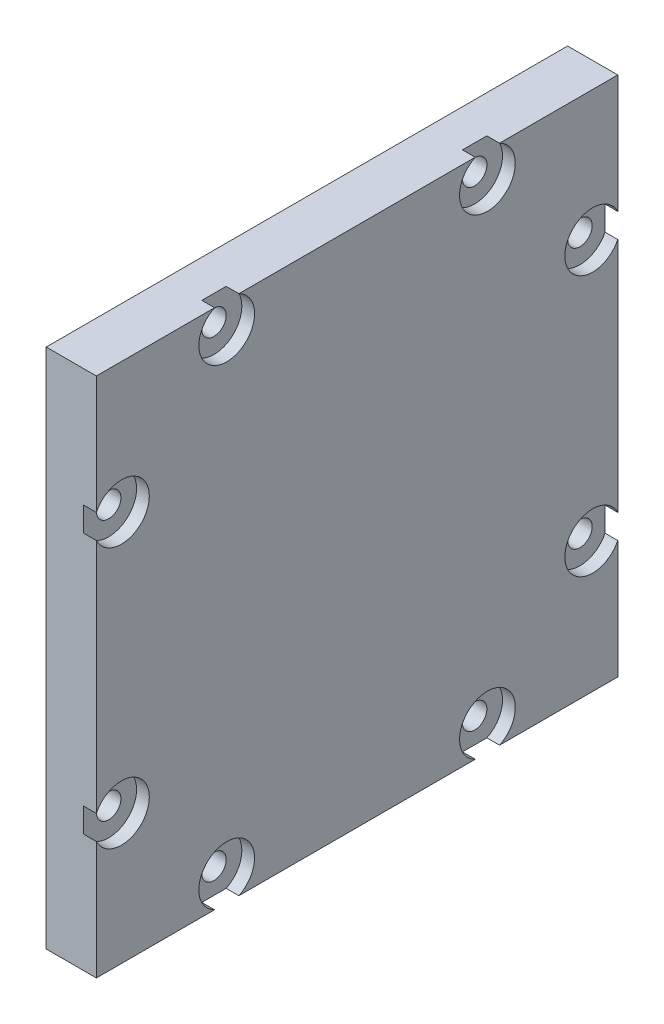
ISO-10303-21;
HEADER;
FILE_DESCRIPTION(('STEP AP214'),'2;1');
FILE_NAME('part.step','',(''),(''),'','','');
FILE_SCHEMA(('AUTOMOTIVE_DESIGN { 1 0 10303 214 1 1 1 1 }'));
ENDSEC;
DATA;
#1=APPLICATION_CONTEXT('core data for automotive mechanical design processes');
#2=APPLICATION_PROTOCOL_DEFINITION('international standard','automotive_design',2000,#1);
#3=PRODUCT_CONTEXT('',#1,'mechanical');
#4=PRODUCT('Part','Part','',(#3));
#5=PRODUCT_RELATED_PRODUCT_CATEGORY('part','',(#4));
#6=PRODUCT_DEFINITION_FORMATION('','',#4);
#7=PRODUCT_DEFINITION_CONTEXT('part definition',#1,'design');
#8=PRODUCT_DEFINITION('design','',#6,#7);
#9=PRODUCT_DEFINITION_SHAPE('','',#8);
#10=(LENGTH_UNIT() NAMED_UNIT(*) SI_UNIT(.MILLI.,.METRE.));
#11=(NAMED_UNIT(*) PLANE_ANGLE_UNIT() SI_UNIT($,.RADIAN.));
#12=(NAMED_UNIT(*) SI_UNIT($,.STERADIAN.) SOLID_ANGLE_UNIT());
#13=UNCERTAINTY_MEASURE_WITH_UNIT(LENGTH_MEASURE(1.E-05),#10,'distance_accuracy_value','');
#14=(GEOMETRIC_REPRESENTATION_CONTEXT(3) GLOBAL_UNCERTAINTY_ASSIGNED_CONTEXT((#13)) GLOBAL_UNIT_ASSIGNED_CONTEXT((#10,
#11,#12)) REPRESENTATION_CONTEXT('',''));
#15=CARTESIAN_POINT('',(0.,0.,0.));
#16=DIRECTION('',(0.,0.,1.));
#17=DIRECTION('',(1.,0.,0.));
#18=AXIS2_PLACEMENT_3D('',#15,#16,#17);
#19=CARTESIAN_POINT('',(0.,0.,0.));
#20=DIRECTION('',(-1.,0.,0.));
#21=DIRECTION('',(0.,0.,1.));
#22=AXIS2_PLACEMENT_3D('',#19,#20,#21);
#23=PLANE('',#22);
#24=CARTESIAN_POINT('',(0.,49.5,-13.));
#25=DIRECTION('',(1.,0.,0.));
#26=DIRECTION('',(0.,0.,-1.));
#27=AXIS2_PLACEMENT_3D('',#24,#25,#26);
#28=CIRCLE('',#27,1.2192);
#29=CARTESIAN_POINT('',(0.,49.5,-14.2192));
#30=VERTEX_POINT('',#29);
#31=EDGE_CURVE('E433',#30,#30,#28,.T.);
#32=ORIENTED_EDGE('',*,*,#31,.T.);
#33=EDGE_LOOP('',(#32));
#34=FACE_BOUND('',#33,.T.);
#35=CARTESIAN_POINT('',(0.,49.5,-39.));
#36=DIRECTION('',(1.,0.,0.));
#37=DIRECTION('',(0.,0.,-1.));
#38=AXIS2_PLACEMENT_3D('',#35,#36,#37);
#39=CIRCLE('',#38,1.2192);
#40=CARTESIAN_POINT('',(0.,49.5,-40.2192));
#41=VERTEX_POINT('',#40);
#42=EDGE_CURVE('E420',#41,#41,#39,.T.);
#43=ORIENTED_EDGE('',*,*,#42,.T.);
#44=EDGE_LOOP('',(#43));
#45=FACE_BOUND('',#44,.T.);
#46=CARTESIAN_POINT('',(0.,39.,-49.5));
#47=DIRECTION('',(1.,0.,0.));
#48=DIRECTION('',(0.,0.,-1.));
#49=AXIS2_PLACEMENT_3D('',#46,#47,#48);
#50=CIRCLE('',#49,1.2192);
#51=CARTESIAN_POINT('',(0.,39.,-50.7192));
#52=VERTEX_POINT('',#51);
#53=EDGE_CURVE('E405',#52,#52,#50,.T.);
#54=ORIENTED_EDGE('',*,*,#53,.T.);
#55=EDGE_LOOP('',(#54));
#56=FACE_BOUND('',#55,.T.);
#57=CARTESIAN_POINT('',(0.,13.,-49.5));
#58=DIRECTION('',(1.,0.,0.));
#59=DIRECTION('',(0.,0.,-1.));
#60=AXIS2_PLACEMENT_3D('',#57,#58,#59);
#61=CIRCLE('',#60,1.2192);
#62=CARTESIAN_POINT('',(0.,13.,-50.7192));
#63=VERTEX_POINT('',#62);
#64=EDGE_CURVE('E390',#63,#63,#61,.T.);
#65=ORIENTED_EDGE('',*,*,#64,.T.);
#66=EDGE_LOOP('',(#65));
#67=FACE_BOUND('',#66,.T.);
#68=CARTESIAN_POINT('',(0.,2.5,-39.));
#69=DIRECTION('',(1.,0.,0.));
#70=DIRECTION('',(0.,0.,-1.));
#71=AXIS2_PLACEMENT_3D('',#68,#69,#70);
#72=CIRCLE('',#71,1.2192);
#73=CARTESIAN_POINT('',(0.,2.5,-40.2192));
#74=VERTEX_POINT('',#73);
#75=EDGE_CURVE('E375',#74,#74,#72,.T.);
#76=ORIENTED_EDGE('',*,*,#75,.T.);
#77=EDGE_LOOP('',(#76));
#78=FACE_BOUND('',#77,.T.);
#79=CARTESIAN_POINT('',(0.,2.5,-13.));
#80=DIRECTION('',(1.,0.,0.));
#81=DIRECTION('',(0.,0.,-1.));
#82=AXIS2_PLACEMENT_3D('',#79,#80,#81);
#83=CIRCLE('',#82,1.2192);
#84=CARTESIAN_POINT('',(0.,2.5,-14.2192));
#85=VERTEX_POINT('',#84);
#86=EDGE_CURVE('E360',#85,#85,#83,.T.);
#87=ORIENTED_EDGE('',*,*,#86,.T.);
#88=EDGE_LOOP('',(#87));
#89=FACE_BOUND('',#88,.T.);
#90=DIRECTION('',(0.,-1.,0.));
#91=VECTOR('',#90,1.);
#92=CARTESIAN_POINT('',(0.,0.,0.));
#93=LINE('',#92,#91);
#94=CARTESIAN_POINT('',(0.,52.,0.));
#95=VERTEX_POINT('',#94);
#96=CARTESIAN_POINT('',(0.,0.,0.));
#97=VERTEX_POINT('',#96);
#98=EDGE_CURVE('E305',#95,#97,#93,.T.);
#99=ORIENTED_EDGE('',*,*,#98,.F.);
#100=DIRECTION('',(0.,0.,1.));
#101=VECTOR('',#100,1.);
#102=CARTESIAN_POINT('',(0.,52.,0.));
#103=LINE('',#102,#101);
#104=CARTESIAN_POINT('',(0.,52.,-52.));
#105=VERTEX_POINT('',#104);
#106=EDGE_CURVE('E295',#105,#95,#103,.T.);
#107=ORIENTED_EDGE('',*,*,#106,.F.);
#108=DIRECTION('',(0.,1.,0.));
#109=VECTOR('',#108,1.);
#110=CARTESIAN_POINT('',(0.,0.,-52.));
#111=LINE('',#110,#109);
#112=CARTESIAN_POINT('',(0.,0.,-52.));
#113=VERTEX_POINT('',#112);
#114=EDGE_CURVE('E299',#113,#105,#111,.T.);
#115=ORIENTED_EDGE('',*,*,#114,.F.);
#116=DIRECTION('',(0.,0.,-1.));
#117=VECTOR('',#116,1.);
#118=CARTESIAN_POINT('',(0.,0.,0.));
#119=LINE('',#118,#117);
#120=EDGE_CURVE('E302',#97,#113,#119,.T.);
#121=ORIENTED_EDGE('',*,*,#120,.F.);
#122=EDGE_LOOP('',(#99,#107,#115,#121));
#123=FACE_BOUND('',#122,.T.);
#124=CARTESIAN_POINT('',(0.,39.,-2.5));
#125=DIRECTION('',(1.,0.,0.));
#126=DIRECTION('',(0.,0.,-1.));
#127=AXIS2_PLACEMENT_3D('',#124,#125,#126);
#128=CIRCLE('',#127,1.2192);
#129=CARTESIAN_POINT('',(0.,39.,-3.7192));
#130=VERTEX_POINT('',#129);
#131=EDGE_CURVE('E309',#130,#130,#128,.T.);
#132=ORIENTED_EDGE('',*,*,#131,.T.);
#133=EDGE_LOOP('',(#132));
#134=FACE_BOUND('',#133,.T.);
#135=CARTESIAN_POINT('',(0.,13.,-2.5));
#136=DIRECTION('',(1.,0.,0.));
#137=DIRECTION('',(0.,0.,-1.));
#138=AXIS2_PLACEMENT_3D('',#135,#136,#137);
#139=CIRCLE('',#138,1.2192);
#140=CARTESIAN_POINT('',(0.,13.,-3.7192));
#141=VERTEX_POINT('',#140);
#142=EDGE_CURVE('E345',#141,#141,#139,.T.);
#143=ORIENTED_EDGE('',*,*,#142,.T.);
#144=EDGE_LOOP('',(#143));
#145=FACE_BOUND('',#144,.T.);
#146=ADVANCED_FACE('F39',(#34,#45,#56,#67,#78,#89,#123,#134,#145),#23,.T.);
#147=CARTESIAN_POINT('',(5.,0.,0.));
#148=DIRECTION('',(-1.,0.,0.));
#149=DIRECTION('',(0.,0.,1.));
#150=AXIS2_PLACEMENT_3D('',#147,#148,#149);
#151=PLANE('',#150);
#152=DIRECTION('',(0.,0.,1.));
#153=VECTOR('',#152,1.);
#154=CARTESIAN_POINT('',(5.,52.,0.));
#155=LINE('',#154,#153);
#156=CARTESIAN_POINT('',(5.,52.,-37.7869430608582));
#157=VERTEX_POINT('',#156);
#158=CARTESIAN_POINT('',(5.,52.,-14.2130569391418));
#159=VERTEX_POINT('',#158);
#160=EDGE_CURVE('E313',#157,#159,#155,.T.);
#161=ORIENTED_EDGE('',*,*,#160,.T.);
#162=CARTESIAN_POINT('',(5.,49.5,-13.));
#163=DIRECTION('',(1.,0.,0.));
#164=DIRECTION('',(0.,0.,-1.));
#165=AXIS2_PLACEMENT_3D('',#162,#163,#164);
#166=CIRCLE('',#165,2.77876);
#167=CARTESIAN_POINT('',(5.,52.,-11.7869430608582));
#168=VERTEX_POINT('',#167);
#169=EDGE_CURVE('E176',#168,#159,#166,.T.);
#170=ORIENTED_EDGE('',*,*,#169,.F.);
#171=CARTESIAN_POINT('',(5.,52.,0.));
#172=VERTEX_POINT('',#171);
#173=EDGE_CURVE('E314',#168,#172,#155,.T.);
#174=ORIENTED_EDGE('',*,*,#173,.T.);
#175=DIRECTION('',(0.,-1.,0.));
#176=VECTOR('',#175,1.);
#177=CARTESIAN_POINT('',(5.,0.,0.));
#178=LINE('',#177,#176);
#179=CARTESIAN_POINT('',(5.,40.2130569391418,0.));
#180=VERTEX_POINT('',#179);
#181=EDGE_CURVE('E327',#172,#180,#178,.T.);
#182=ORIENTED_EDGE('',*,*,#181,.T.);
#183=CARTESIAN_POINT('',(5.,39.,-2.5));
#184=DIRECTION('',(1.,0.,0.));
#185=DIRECTION('',(0.,0.,-1.));
#186=AXIS2_PLACEMENT_3D('',#183,#184,#185);
#187=CIRCLE('',#186,2.77875999999999);
#188=CARTESIAN_POINT('',(5.,37.7869430608582,0.));
#189=VERTEX_POINT('',#188);
#190=EDGE_CURVE('E342',#189,#180,#187,.T.);
#191=ORIENTED_EDGE('',*,*,#190,.F.);
#192=CARTESIAN_POINT('',(5.,14.2130569391418,0.));
#193=VERTEX_POINT('',#192);
#194=EDGE_CURVE('E331',#189,#193,#178,.T.);
#195=ORIENTED_EDGE('',*,*,#194,.T.);
#196=CARTESIAN_POINT('',(5.,13.,-2.5));
#197=DIRECTION('',(1.,0.,0.));
#198=DIRECTION('',(0.,0.,-1.));
#199=AXIS2_PLACEMENT_3D('',#196,#197,#198);
#200=CIRCLE('',#199,2.77875999999999);
#201=CARTESIAN_POINT('',(5.,11.7869430608582,0.));
#202=VERTEX_POINT('',#201);
#203=EDGE_CURVE('E357',#202,#193,#200,.T.);
#204=ORIENTED_EDGE('',*,*,#203,.F.);
#205=CARTESIAN_POINT('',(5.,0.,0.));
#206=VERTEX_POINT('',#205);
#207=EDGE_CURVE('E298',#202,#206,#178,.T.);
#208=ORIENTED_EDGE('',*,*,#207,.T.);
#209=DIRECTION('',(0.,0.,-1.));
#210=VECTOR('',#209,1.);
#211=CARTESIAN_POINT('',(5.,0.,0.));
#212=LINE('',#211,#210);
#213=CARTESIAN_POINT('',(5.,0.,-11.7869430608582));
#214=VERTEX_POINT('',#213);
#215=EDGE_CURVE('E321',#206,#214,#212,.T.);
#216=ORIENTED_EDGE('',*,*,#215,.T.);
#217=CARTESIAN_POINT('',(5.,2.5,-13.));
#218=DIRECTION('',(1.,0.,0.));
#219=DIRECTION('',(0.,0.,-1.));
#220=AXIS2_PLACEMENT_3D('',#217,#218,#219);
#221=CIRCLE('',#220,2.77875999999999);
#222=CARTESIAN_POINT('',(5.,0.,-14.2130569391418));
#223=VERTEX_POINT('',#222);
#224=EDGE_CURVE('E372',#223,#214,#221,.T.);
#225=ORIENTED_EDGE('',*,*,#224,.F.);
#226=CARTESIAN_POINT('',(5.,0.,-37.7869430608582));
#227=VERTEX_POINT('',#226);
#228=EDGE_CURVE('E325',#223,#227,#212,.T.);
#229=ORIENTED_EDGE('',*,*,#228,.T.);
#230=CARTESIAN_POINT('',(5.,2.5,-39.));
#231=DIRECTION('',(1.,0.,0.));
#232=DIRECTION('',(0.,0.,-1.));
#233=AXIS2_PLACEMENT_3D('',#230,#231,#232);
#234=CIRCLE('',#233,2.77875999999999);
#235=CARTESIAN_POINT('',(5.,0.,-40.2130569391418));
#236=VERTEX_POINT('',#235);
#237=EDGE_CURVE('E387',#236,#227,#234,.T.);
#238=ORIENTED_EDGE('',*,*,#237,.F.);
#239=CARTESIAN_POINT('',(5.,0.,-52.));
#240=VERTEX_POINT('',#239);
#241=EDGE_CURVE('E326',#236,#240,#212,.T.);
#242=ORIENTED_EDGE('',*,*,#241,.T.);
#243=DIRECTION('',(0.,1.,0.));
#244=VECTOR('',#243,1.);
#245=CARTESIAN_POINT('',(5.,0.,-52.));
#246=LINE('',#245,#244);
#247=CARTESIAN_POINT('',(5.,11.7869430608582,-52.));
#248=VERTEX_POINT('',#247);
#249=EDGE_CURVE('E315',#240,#248,#246,.T.);
#250=ORIENTED_EDGE('',*,*,#249,.T.);
#251=CARTESIAN_POINT('',(5.,13.,-49.5));
#252=DIRECTION('',(1.,0.,0.));
#253=DIRECTION('',(0.,0.,-1.));
#254=AXIS2_PLACEMENT_3D('',#251,#252,#253);
#255=CIRCLE('',#254,2.77875999999999);
#256=CARTESIAN_POINT('',(5.,14.2130569391417,-52.));
#257=VERTEX_POINT('',#256);
#258=EDGE_CURVE('E402',#257,#248,#255,.T.);
#259=ORIENTED_EDGE('',*,*,#258,.F.);
#260=CARTESIAN_POINT('',(5.,37.7869430608582,-52.));
#261=VERTEX_POINT('',#260);
#262=EDGE_CURVE('E319',#257,#261,#246,.T.);
#263=ORIENTED_EDGE('',*,*,#262,.T.);
#264=CARTESIAN_POINT('',(5.,39.,-49.5));
#265=DIRECTION('',(1.,0.,0.));
#266=DIRECTION('',(0.,0.,-1.));
#267=AXIS2_PLACEMENT_3D('',#264,#265,#266);
#268=CIRCLE('',#267,2.77875999999999);
#269=CARTESIAN_POINT('',(5.,40.2130569391418,-52.));
#270=VERTEX_POINT('',#269);
#271=EDGE_CURVE('E417',#270,#261,#268,.T.);
#272=ORIENTED_EDGE('',*,*,#271,.F.);
#273=CARTESIAN_POINT('',(5.,52.,-52.));
#274=VERTEX_POINT('',#273);
#275=EDGE_CURVE('E320',#270,#274,#246,.T.);
#276=ORIENTED_EDGE('',*,*,#275,.T.);
#277=CARTESIAN_POINT('',(5.,52.,-40.2130569391418));
#278=VERTEX_POINT('',#277);
#279=EDGE_CURVE('E294',#274,#278,#155,.T.);
#280=ORIENTED_EDGE('',*,*,#279,.T.);
#281=CARTESIAN_POINT('',(5.,49.5,-39.));
#282=DIRECTION('',(1.,0.,0.));
#283=DIRECTION('',(0.,0.,-1.));
#284=AXIS2_PLACEMENT_3D('',#281,#282,#283);
#285=CIRCLE('',#284,2.77876);
#286=EDGE_CURVE('E430',#157,#278,#285,.T.);
#287=ORIENTED_EDGE('',*,*,#286,.F.);
#288=EDGE_LOOP('',(#161,#170,#174,#182,#191,#195,#204,#208,#216,#225,#229,#238,#242,#250,#259,
#263,#272,#276,#280,#287));
#289=FACE_BOUND('',#288,.T.);
#290=ADVANCED_FACE('F454',(#289),#151,.F.);
#291=CARTESIAN_POINT('',(5.,0.,0.));
#292=DIRECTION('',(0.,0.,-1.));
#293=DIRECTION('',(-1.,0.,0.));
#294=AXIS2_PLACEMENT_3D('',#291,#292,#293);
#295=PLANE('',#294);
#296=DIRECTION('',(0.,1.,0.));
#297=VECTOR('',#296,1.);
#298=CARTESIAN_POINT('',(3.73,0.,0.));
#299=LINE('',#298,#297);
#300=CARTESIAN_POINT('',(3.73,11.7869430608582,0.));
#301=VERTEX_POINT('',#300);
#302=CARTESIAN_POINT('',(3.73,14.2130569391418,0.));
#303=VERTEX_POINT('',#302);
#304=EDGE_CURVE('E258',#301,#303,#299,.T.);
#305=ORIENTED_EDGE('',*,*,#304,.T.);
#306=DIRECTION('',(1.,0.,0.));
#307=VECTOR('',#306,1.);
#308=CARTESIAN_POINT('',(5.,14.2130569391418,0.));
#309=LINE('',#308,#307);
#310=EDGE_CURVE('E254',#303,#193,#309,.T.);
#311=ORIENTED_EDGE('',*,*,#310,.T.);
#312=ORIENTED_EDGE('',*,*,#194,.F.);
#313=DIRECTION('',(1.,0.,0.));
#314=VECTOR('',#313,1.);
#315=CARTESIAN_POINT('',(5.,37.7869430608582,0.));
#316=LINE('',#315,#314);
#317=CARTESIAN_POINT('',(3.73,37.7869430608582,0.));
#318=VERTEX_POINT('',#317);
#319=EDGE_CURVE('E270',#189,#318,#316,.F.);
#320=ORIENTED_EDGE('',*,*,#319,.T.);
#321=DIRECTION('',(0.,1.,0.));
#322=VECTOR('',#321,1.);
#323=CARTESIAN_POINT('',(3.73,0.,0.));
#324=LINE('',#323,#322);
#325=CARTESIAN_POINT('',(3.73,40.2130569391418,0.));
#326=VERTEX_POINT('',#325);
#327=EDGE_CURVE('E274',#318,#326,#324,.T.);
#328=ORIENTED_EDGE('',*,*,#327,.T.);
#329=DIRECTION('',(1.,0.,0.));
#330=VECTOR('',#329,1.);
#331=CARTESIAN_POINT('',(5.,40.2130569391418,0.));
#332=LINE('',#331,#330);
#333=EDGE_CURVE('E266',#326,#180,#332,.T.);
#334=ORIENTED_EDGE('',*,*,#333,.T.);
#335=ORIENTED_EDGE('',*,*,#181,.F.);
#336=DIRECTION('',(-1.,0.,0.));
#337=VECTOR('',#336,1.);
#338=CARTESIAN_POINT('',(5.,52.,0.));
#339=LINE('',#338,#337);
#340=EDGE_CURVE('E290',#172,#95,#339,.T.);
#341=ORIENTED_EDGE('',*,*,#340,.T.);
#342=ORIENTED_EDGE('',*,*,#98,.T.);
#343=DIRECTION('',(-1.,0.,0.));
#344=VECTOR('',#343,1.);
#345=CARTESIAN_POINT('',(5.,0.,0.));
#346=LINE('',#345,#344);
#347=EDGE_CURVE('E278',#206,#97,#346,.T.);
#348=ORIENTED_EDGE('',*,*,#347,.F.);
#349=ORIENTED_EDGE('',*,*,#207,.F.);
#350=DIRECTION('',(1.,0.,0.));
#351=VECTOR('',#350,1.);
#352=CARTESIAN_POINT('',(5.,11.7869430608582,0.));
#353=LINE('',#352,#351);
#354=EDGE_CURVE('E262',#202,#301,#353,.F.);
#355=ORIENTED_EDGE('',*,*,#354,.T.);
#356=EDGE_LOOP('',(#305,#311,#312,#320,#328,#334,#335,#341,#342,#348,#349,#355));
#357=FACE_BOUND('',#356,.T.);
#358=ADVANCED_FACE('F41',(#357),#295,.F.);
#359=CARTESIAN_POINT('',(5.,0.,0.));
#360=DIRECTION('',(0.,1.,0.));
#361=DIRECTION('',(0.,0.,1.));
#362=AXIS2_PLACEMENT_3D('',#359,#360,#361);
#363=PLANE('',#362);
#364=DIRECTION('',(0.,0.,1.));
#365=VECTOR('',#364,1.);
#366=CARTESIAN_POINT('',(3.73,0.,0.));
#367=LINE('',#366,#365);
#368=CARTESIAN_POINT('',(3.73,0.,-40.2130569391418));
#369=VERTEX_POINT('',#368);
#370=CARTESIAN_POINT('',(3.73,0.,-37.7869430608582));
#371=VERTEX_POINT('',#370);
#372=EDGE_CURVE('E234',#369,#371,#367,.T.);
#373=ORIENTED_EDGE('',*,*,#372,.T.);
#374=DIRECTION('',(1.,0.,0.));
#375=VECTOR('',#374,1.);
#376=CARTESIAN_POINT('',(5.,0.,-37.7869430608582));
#377=LINE('',#376,#375);
#378=EDGE_CURVE('E230',#371,#227,#377,.T.);
#379=ORIENTED_EDGE('',*,*,#378,.T.);
#380=ORIENTED_EDGE('',*,*,#228,.F.);
#381=DIRECTION('',(1.,0.,0.));
#382=VECTOR('',#381,1.);
#383=CARTESIAN_POINT('',(5.,0.,-14.2130569391418));
#384=LINE('',#383,#382);
#385=CARTESIAN_POINT('',(3.73,0.,-14.2130569391418));
#386=VERTEX_POINT('',#385);
#387=EDGE_CURVE('E250',#223,#386,#384,.F.);
#388=ORIENTED_EDGE('',*,*,#387,.T.);
#389=DIRECTION('',(0.,0.,1.));
#390=VECTOR('',#389,1.);
#391=CARTESIAN_POINT('',(3.73,0.,0.));
#392=LINE('',#391,#390);
#393=CARTESIAN_POINT('',(3.73,0.,-11.7869430608582));
#394=VERTEX_POINT('',#393);
#395=EDGE_CURVE('E246',#386,#394,#392,.T.);
#396=ORIENTED_EDGE('',*,*,#395,.T.);
#397=DIRECTION('',(1.,0.,0.));
#398=VECTOR('',#397,1.);
#399=CARTESIAN_POINT('',(5.,0.,-11.7869430608582));
#400=LINE('',#399,#398);
#401=EDGE_CURVE('E242',#394,#214,#400,.T.);
#402=ORIENTED_EDGE('',*,*,#401,.T.);
#403=ORIENTED_EDGE('',*,*,#215,.F.);
#404=ORIENTED_EDGE('',*,*,#347,.T.);
#405=ORIENTED_EDGE('',*,*,#120,.T.);
#406=DIRECTION('',(-1.,0.,0.));
#407=VECTOR('',#406,1.);
#408=CARTESIAN_POINT('',(5.,0.,-52.));
#409=LINE('',#408,#407);
#410=EDGE_CURVE('E282',#240,#113,#409,.T.);
#411=ORIENTED_EDGE('',*,*,#410,.F.);
#412=ORIENTED_EDGE('',*,*,#241,.F.);
#413=DIRECTION('',(1.,0.,0.));
#414=VECTOR('',#413,1.);
#415=CARTESIAN_POINT('',(5.,0.,-40.2130569391418));
#416=LINE('',#415,#414);
#417=EDGE_CURVE('E238',#236,#369,#416,.F.);
#418=ORIENTED_EDGE('',*,*,#417,.T.);
#419=EDGE_LOOP('',(#373,#379,#380,#388,#396,#402,#403,#404,#405,#411,#412,#418));
#420=FACE_BOUND('',#419,.T.);
#421=ADVANCED_FACE('F485',(#420),#363,.F.);
#422=CARTESIAN_POINT('',(5.,0.,-52.));
#423=DIRECTION('',(0.,0.,1.));
#424=DIRECTION('',(1.,0.,0.));
#425=AXIS2_PLACEMENT_3D('',#422,#423,#424);
#426=PLANE('',#425);
#427=DIRECTION('',(0.,-1.,0.));
#428=VECTOR('',#427,1.);
#429=CARTESIAN_POINT('',(3.73,0.,-52.));
#430=LINE('',#429,#428);
#431=CARTESIAN_POINT('',(3.73,40.2130569391418,-52.));
#432=VERTEX_POINT('',#431);
#433=CARTESIAN_POINT('',(3.73,37.7869430608582,-52.));
#434=VERTEX_POINT('',#433);
#435=EDGE_CURVE('E210',#432,#434,#430,.T.);
#436=ORIENTED_EDGE('',*,*,#435,.T.);
#437=DIRECTION('',(1.,0.,0.));
#438=VECTOR('',#437,1.);
#439=CARTESIAN_POINT('',(5.,37.7869430608582,-52.));
#440=LINE('',#439,#438);
#441=EDGE_CURVE('E206',#434,#261,#440,.T.);
#442=ORIENTED_EDGE('',*,*,#441,.T.);
#443=ORIENTED_EDGE('',*,*,#262,.F.);
#444=DIRECTION('',(1.,0.,0.));
#445=VECTOR('',#444,1.);
#446=CARTESIAN_POINT('',(5.,14.2130569391417,-52.));
#447=LINE('',#446,#445);
#448=CARTESIAN_POINT('',(3.73,14.2130569391417,-52.));
#449=VERTEX_POINT('',#448);
#450=EDGE_CURVE('E226',#257,#449,#447,.F.);
#451=ORIENTED_EDGE('',*,*,#450,.T.);
#452=DIRECTION('',(0.,-1.,0.));
#453=VECTOR('',#452,1.);
#454=CARTESIAN_POINT('',(3.73,0.,-52.));
#455=LINE('',#454,#453);
#456=CARTESIAN_POINT('',(3.73,11.7869430608582,-52.));
#457=VERTEX_POINT('',#456);
#458=EDGE_CURVE('E222',#449,#457,#455,.T.);
#459=ORIENTED_EDGE('',*,*,#458,.T.);
#460=DIRECTION('',(1.,0.,0.));
#461=VECTOR('',#460,1.);
#462=CARTESIAN_POINT('',(5.,11.7869430608582,-52.));
#463=LINE('',#462,#461);
#464=EDGE_CURVE('E218',#457,#248,#463,.T.);
#465=ORIENTED_EDGE('',*,*,#464,.T.);
#466=ORIENTED_EDGE('',*,*,#249,.F.);
#467=ORIENTED_EDGE('',*,*,#410,.T.);
#468=ORIENTED_EDGE('',*,*,#114,.T.);
#469=DIRECTION('',(-1.,0.,0.));
#470=VECTOR('',#469,1.);
#471=CARTESIAN_POINT('',(5.,52.,-52.));
#472=LINE('',#471,#470);
#473=EDGE_CURVE('E286',#274,#105,#472,.T.);
#474=ORIENTED_EDGE('',*,*,#473,.F.);
#475=ORIENTED_EDGE('',*,*,#275,.F.);
#476=DIRECTION('',(1.,0.,0.));
#477=VECTOR('',#476,1.);
#478=CARTESIAN_POINT('',(5.,40.2130569391418,-52.));
#479=LINE('',#478,#477);
#480=EDGE_CURVE('E214',#270,#432,#479,.F.);
#481=ORIENTED_EDGE('',*,*,#480,.T.);
#482=EDGE_LOOP('',(#436,#442,#443,#451,#459,#465,#466,#467,#468,#474,#475,#481));
#483=FACE_BOUND('',#482,.T.);
#484=ADVANCED_FACE('F461',(#483),#426,.F.);
#485=CARTESIAN_POINT('',(5.,52.,0.));
#486=DIRECTION('',(0.,-1.,0.));
#487=DIRECTION('',(0.,0.,-1.));
#488=AXIS2_PLACEMENT_3D('',#485,#486,#487);
#489=PLANE('',#488);
#490=DIRECTION('',(0.,0.,-1.));
#491=VECTOR('',#490,1.);
#492=CARTESIAN_POINT('',(3.73,52.,0.));
#493=LINE('',#492,#491);
#494=CARTESIAN_POINT('',(3.73,52.,-11.7869430608582));
#495=VERTEX_POINT('',#494);
#496=CARTESIAN_POINT('',(3.73,52.,-14.2130569391418));
#497=VERTEX_POINT('',#496);
#498=EDGE_CURVE('E48',#495,#497,#493,.T.);
#499=ORIENTED_EDGE('',*,*,#498,.T.);
#500=DIRECTION('',(1.,0.,0.));
#501=VECTOR('',#500,1.);
#502=CARTESIAN_POINT('',(5.,52.,-14.2130569391418));
#503=LINE('',#502,#501);
#504=EDGE_CURVE('E11',#497,#159,#503,.T.);
#505=ORIENTED_EDGE('',*,*,#504,.T.);
#506=ORIENTED_EDGE('',*,*,#160,.F.);
#507=DIRECTION('',(1.,0.,0.));
#508=VECTOR('',#507,1.);
#509=CARTESIAN_POINT('',(5.,52.,-37.7869430608582));
#510=LINE('',#509,#508);
#511=CARTESIAN_POINT('',(3.73,52.,-37.7869430608582));
#512=VERTEX_POINT('',#511);
#513=EDGE_CURVE('E202',#157,#512,#510,.F.);
#514=ORIENTED_EDGE('',*,*,#513,.T.);
#515=DIRECTION('',(0.,0.,-1.));
#516=VECTOR('',#515,1.);
#517=CARTESIAN_POINT('',(3.73,52.,0.));
#518=LINE('',#517,#516);
#519=CARTESIAN_POINT('',(3.73,52.,-40.2130569391418));
#520=VERTEX_POINT('',#519);
#521=EDGE_CURVE('E198',#512,#520,#518,.T.);
#522=ORIENTED_EDGE('',*,*,#521,.T.);
#523=DIRECTION('',(1.,0.,0.));
#524=VECTOR('',#523,1.);
#525=CARTESIAN_POINT('',(5.,52.,-40.2130569391418));
#526=LINE('',#525,#524);
#527=EDGE_CURVE('E192',#520,#278,#526,.T.);
#528=ORIENTED_EDGE('',*,*,#527,.T.);
#529=ORIENTED_EDGE('',*,*,#279,.F.);
#530=ORIENTED_EDGE('',*,*,#473,.T.);
#531=ORIENTED_EDGE('',*,*,#106,.T.);
#532=ORIENTED_EDGE('',*,*,#340,.F.);
#533=ORIENTED_EDGE('',*,*,#173,.F.);
#534=DIRECTION('',(1.,0.,0.));
#535=VECTOR('',#534,1.);
#536=CARTESIAN_POINT('',(5.,52.,-11.7869430608582));
#537=LINE('',#536,#535);
#538=EDGE_CURVE('E189',#168,#495,#537,.F.);
#539=ORIENTED_EDGE('',*,*,#538,.T.);
#540=EDGE_LOOP('',(#499,#505,#506,#514,#522,#528,#529,#530,#531,#532,#533,#539));
#541=FACE_BOUND('',#540,.T.);
#542=ADVANCED_FACE('F187',(#541),#489,.F.);
#543=CARTESIAN_POINT('',(5.,39.,-2.5));
#544=DIRECTION('',(1.,0.,0.));
#545=DIRECTION('',(0.,0.,-1.));
#546=AXIS2_PLACEMENT_3D('',#543,#544,#545);
#547=CYLINDRICAL_SURFACE('',#546,2.77875999999999);
#548=CARTESIAN_POINT('',(3.73,39.,-2.5));
#549=DIRECTION('',(1.,0.,0.));
#550=DIRECTION('',(0.,0.,-1.));
#551=AXIS2_PLACEMENT_3D('',#548,#549,#550);
#552=CIRCLE('',#551,2.77876);
#553=EDGE_CURVE('E339',#318,#326,#552,.T.);
#554=ORIENTED_EDGE('',*,*,#553,.F.);
#555=ORIENTED_EDGE('',*,*,#319,.F.);
#556=ORIENTED_EDGE('',*,*,#190,.T.);
#557=ORIENTED_EDGE('',*,*,#333,.F.);
#558=EDGE_LOOP('',(#554,#555,#556,#557));
#559=FACE_BOUND('',#558,.T.);
#560=ADVANCED_FACE('F532',(#559),#547,.F.);
#561=CARTESIAN_POINT('',(3.73,40.2192,-2.5));
#562=DIRECTION('',(-1.,0.,0.));
#563=DIRECTION('',(0.,0.,1.));
#564=AXIS2_PLACEMENT_3D('',#561,#562,#563);
#565=PLANE('',#564);
#566=CARTESIAN_POINT('',(3.73,39.,-2.5));
#567=DIRECTION('',(1.,0.,0.));
#568=DIRECTION('',(0.,0.,-1.));
#569=AXIS2_PLACEMENT_3D('',#566,#567,#568);
#570=CIRCLE('',#569,1.2192);
#571=CARTESIAN_POINT('',(3.73,39.,-3.7192));
#572=VERTEX_POINT('',#571);
#573=EDGE_CURVE('E335',#572,#572,#570,.T.);
#574=ORIENTED_EDGE('',*,*,#573,.F.);
#575=EDGE_LOOP('',(#574));
#576=FACE_BOUND('',#575,.T.);
#577=ORIENTED_EDGE('',*,*,#553,.T.);
#578=ORIENTED_EDGE('',*,*,#327,.F.);
#579=EDGE_LOOP('',(#577,#578));
#580=FACE_BOUND('',#579,.T.);
#581=ADVANCED_FACE('F559',(#576,#580),#565,.F.);
#582=CARTESIAN_POINT('',(5.,39.,-2.5));
#583=DIRECTION('',(1.,0.,0.));
#584=DIRECTION('',(0.,0.,-1.));
#585=AXIS2_PLACEMENT_3D('',#582,#583,#584);
#586=CYLINDRICAL_SURFACE('',#585,1.2192);
#587=ORIENTED_EDGE('',*,*,#131,.F.);
#588=EDGE_LOOP('',(#587));
#589=FACE_BOUND('',#588,.T.);
#590=ORIENTED_EDGE('',*,*,#573,.T.);
#591=EDGE_LOOP('',(#590));
#592=FACE_BOUND('',#591,.T.);
#593=ADVANCED_FACE('F568',(#589,#592),#586,.F.);
#594=CARTESIAN_POINT('',(3.73,14.2192,-2.5));
#595=DIRECTION('',(-1.,0.,0.));
#596=DIRECTION('',(0.,0.,1.));
#597=AXIS2_PLACEMENT_3D('',#594,#595,#596);
#598=PLANE('',#597);
#599=CARTESIAN_POINT('',(3.73,13.,-2.5));
#600=DIRECTION('',(1.,0.,0.));
#601=DIRECTION('',(0.,0.,-1.));
#602=AXIS2_PLACEMENT_3D('',#599,#600,#601);
#603=CIRCLE('',#602,1.2192);
#604=CARTESIAN_POINT('',(3.73,13.,-3.7192));
#605=VERTEX_POINT('',#604);
#606=EDGE_CURVE('E349',#605,#605,#603,.T.);
#607=ORIENTED_EDGE('',*,*,#606,.F.);
#608=EDGE_LOOP('',(#607));
#609=FACE_BOUND('',#608,.T.);
#610=CARTESIAN_POINT('',(3.73,13.,-2.5));
#611=DIRECTION('',(1.,0.,0.));
#612=DIRECTION('',(0.,0.,-1.));
#613=AXIS2_PLACEMENT_3D('',#610,#611,#612);
#614=CIRCLE('',#613,2.77875999999999);
#615=EDGE_CURVE('E353',#301,#303,#614,.T.);
#616=ORIENTED_EDGE('',*,*,#615,.T.);
#617=ORIENTED_EDGE('',*,*,#304,.F.);
#618=EDGE_LOOP('',(#616,#617));
#619=FACE_BOUND('',#618,.T.);
#620=ADVANCED_FACE('F481',(#609,#619),#598,.F.);
#621=CARTESIAN_POINT('',(5.,13.,-2.5));
#622=DIRECTION('',(1.,0.,0.));
#623=DIRECTION('',(0.,0.,-1.));
#624=AXIS2_PLACEMENT_3D('',#621,#622,#623);
#625=CYLINDRICAL_SURFACE('',#624,2.77875999999999);
#626=ORIENTED_EDGE('',*,*,#615,.F.);
#627=ORIENTED_EDGE('',*,*,#354,.F.);
#628=ORIENTED_EDGE('',*,*,#203,.T.);
#629=ORIENTED_EDGE('',*,*,#310,.F.);
#630=EDGE_LOOP('',(#626,#627,#628,#629));
#631=FACE_BOUND('',#630,.T.);
#632=ADVANCED_FACE('F479',(#631),#625,.F.);
#633=CARTESIAN_POINT('',(5.,13.,-2.5));
#634=DIRECTION('',(1.,0.,0.));
#635=DIRECTION('',(0.,0.,-1.));
#636=AXIS2_PLACEMENT_3D('',#633,#634,#635);
#637=CYLINDRICAL_SURFACE('',#636,1.2192);
#638=ORIENTED_EDGE('',*,*,#142,.F.);
#639=EDGE_LOOP('',(#638));
#640=FACE_BOUND('',#639,.T.);
#641=ORIENTED_EDGE('',*,*,#606,.T.);
#642=EDGE_LOOP('',(#641));
#643=FACE_BOUND('',#642,.T.);
#644=ADVANCED_FACE('F592',(#640,#643),#637,.F.);
#645=CARTESIAN_POINT('',(3.73,3.7192,-13.));
#646=DIRECTION('',(-1.,0.,0.));
#647=DIRECTION('',(0.,0.,1.));
#648=AXIS2_PLACEMENT_3D('',#645,#646,#647);
#649=PLANE('',#648);
#650=CARTESIAN_POINT('',(3.73,2.5,-13.));
#651=DIRECTION('',(1.,0.,0.));
#652=DIRECTION('',(0.,0.,-1.));
#653=AXIS2_PLACEMENT_3D('',#650,#651,#652);
#654=CIRCLE('',#653,1.2192);
#655=CARTESIAN_POINT('',(3.73,2.5,-14.2192));
#656=VERTEX_POINT('',#655);
#657=EDGE_CURVE('E364',#656,#656,#654,.T.);
#658=ORIENTED_EDGE('',*,*,#657,.F.);
#659=EDGE_LOOP('',(#658));
#660=FACE_BOUND('',#659,.T.);
#661=CARTESIAN_POINT('',(3.73,2.5,-13.));
#662=DIRECTION('',(1.,0.,0.));
#663=DIRECTION('',(0.,0.,-1.));
#664=AXIS2_PLACEMENT_3D('',#661,#662,#663);
#665=CIRCLE('',#664,2.77876);
#666=EDGE_CURVE('E368',#386,#394,#665,.T.);
#667=ORIENTED_EDGE('',*,*,#666,.T.);
#668=ORIENTED_EDGE('',*,*,#395,.F.);
#669=EDGE_LOOP('',(#667,#668));
#670=FACE_BOUND('',#669,.T.);
#671=ADVANCED_FACE('F490',(#660,#670),#649,.F.);
#672=CARTESIAN_POINT('',(5.,2.5,-13.));
#673=DIRECTION('',(1.,0.,0.));
#674=DIRECTION('',(0.,0.,-1.));
#675=AXIS2_PLACEMENT_3D('',#672,#673,#674);
#676=CYLINDRICAL_SURFACE('',#675,2.77876);
#677=ORIENTED_EDGE('',*,*,#666,.F.);
#678=ORIENTED_EDGE('',*,*,#387,.F.);
#679=ORIENTED_EDGE('',*,*,#224,.T.);
#680=ORIENTED_EDGE('',*,*,#401,.F.);
#681=EDGE_LOOP('',(#677,#678,#679,#680));
#682=FACE_BOUND('',#681,.T.);
#683=ADVANCED_FACE('F488',(#682),#676,.F.);
#684=CARTESIAN_POINT('',(5.,2.5,-13.));
#685=DIRECTION('',(1.,0.,0.));
#686=DIRECTION('',(0.,0.,-1.));
#687=AXIS2_PLACEMENT_3D('',#684,#685,#686);
#688=CYLINDRICAL_SURFACE('',#687,1.2192);
#689=ORIENTED_EDGE('',*,*,#86,.F.);
#690=EDGE_LOOP('',(#689));
#691=FACE_BOUND('',#690,.T.);
#692=ORIENTED_EDGE('',*,*,#657,.T.);
#693=EDGE_LOOP('',(#692));
#694=FACE_BOUND('',#693,.T.);
#695=ADVANCED_FACE('F616',(#691,#694),#688,.F.);
#696=CARTESIAN_POINT('',(3.73,3.7192,-39.));
#697=DIRECTION('',(-1.,0.,0.));
#698=DIRECTION('',(0.,0.,1.));
#699=AXIS2_PLACEMENT_3D('',#696,#697,#698);
#700=PLANE('',#699);
#701=CARTESIAN_POINT('',(3.73,2.5,-39.));
#702=DIRECTION('',(1.,0.,0.));
#703=DIRECTION('',(0.,0.,-1.));
#704=AXIS2_PLACEMENT_3D('',#701,#702,#703);
#705=CIRCLE('',#704,1.2192);
#706=CARTESIAN_POINT('',(3.73,2.5,-40.2192));
#707=VERTEX_POINT('',#706);
#708=EDGE_CURVE('E379',#707,#707,#705,.T.);
#709=ORIENTED_EDGE('',*,*,#708,.F.);
#710=EDGE_LOOP('',(#709));
#711=FACE_BOUND('',#710,.T.);
#712=CARTESIAN_POINT('',(3.73,2.5,-39.));
#713=DIRECTION('',(1.,0.,0.));
#714=DIRECTION('',(0.,0.,-1.));
#715=AXIS2_PLACEMENT_3D('',#712,#713,#714);
#716=CIRCLE('',#715,2.77876);
#717=EDGE_CURVE('E383',#369,#371,#716,.T.);
#718=ORIENTED_EDGE('',*,*,#717,.T.);
#719=ORIENTED_EDGE('',*,*,#372,.F.);
#720=EDGE_LOOP('',(#718,#719));
#721=FACE_BOUND('',#720,.T.);
#722=ADVANCED_FACE('F624',(#711,#721),#700,.F.);
#723=CARTESIAN_POINT('',(5.,2.5,-39.));
#724=DIRECTION('',(1.,0.,0.));
#725=DIRECTION('',(0.,0.,-1.));
#726=AXIS2_PLACEMENT_3D('',#723,#724,#725);
#727=CYLINDRICAL_SURFACE('',#726,2.77876);
#728=ORIENTED_EDGE('',*,*,#717,.F.);
#729=ORIENTED_EDGE('',*,*,#417,.F.);
#730=ORIENTED_EDGE('',*,*,#237,.T.);
#731=ORIENTED_EDGE('',*,*,#378,.F.);
#732=EDGE_LOOP('',(#728,#729,#730,#731));
#733=FACE_BOUND('',#732,.T.);
#734=ADVANCED_FACE('F633',(#733),#727,.F.);
#735=CARTESIAN_POINT('',(5.,2.5,-39.));
#736=DIRECTION('',(1.,0.,0.));
#737=DIRECTION('',(0.,0.,-1.));
#738=AXIS2_PLACEMENT_3D('',#735,#736,#737);
#739=CYLINDRICAL_SURFACE('',#738,1.2192);
#740=ORIENTED_EDGE('',*,*,#75,.F.);
#741=EDGE_LOOP('',(#740));
#742=FACE_BOUND('',#741,.T.);
#743=ORIENTED_EDGE('',*,*,#708,.T.);
#744=EDGE_LOOP('',(#743));
#745=FACE_BOUND('',#744,.T.);
#746=ADVANCED_FACE('F642',(#742,#745),#739,.F.);
#747=CARTESIAN_POINT('',(3.73,14.2192,-49.5));
#748=DIRECTION('',(-1.,0.,0.));
#749=DIRECTION('',(0.,0.,1.));
#750=AXIS2_PLACEMENT_3D('',#747,#748,#749);
#751=PLANE('',#750);
#752=CARTESIAN_POINT('',(3.73,13.,-49.5));
#753=DIRECTION('',(1.,0.,0.));
#754=DIRECTION('',(0.,0.,-1.));
#755=AXIS2_PLACEMENT_3D('',#752,#753,#754);
#756=CIRCLE('',#755,1.2192);
#757=CARTESIAN_POINT('',(3.73,13.,-50.7192));
#758=VERTEX_POINT('',#757);
#759=EDGE_CURVE('E394',#758,#758,#756,.T.);
#760=ORIENTED_EDGE('',*,*,#759,.F.);
#761=EDGE_LOOP('',(#760));
#762=FACE_BOUND('',#761,.T.);
#763=CARTESIAN_POINT('',(3.73,13.,-49.5));
#764=DIRECTION('',(1.,0.,0.));
#765=DIRECTION('',(0.,0.,-1.));
#766=AXIS2_PLACEMENT_3D('',#763,#764,#765);
#767=CIRCLE('',#766,2.77876);
#768=EDGE_CURVE('E398',#449,#457,#767,.T.);
#769=ORIENTED_EDGE('',*,*,#768,.T.);
#770=ORIENTED_EDGE('',*,*,#458,.F.);
#771=EDGE_LOOP('',(#769,#770));
#772=FACE_BOUND('',#771,.T.);
#773=ADVANCED_FACE('F650',(#762,#772),#751,.F.);
#774=CARTESIAN_POINT('',(5.,13.,-49.5));
#775=DIRECTION('',(1.,0.,0.));
#776=DIRECTION('',(0.,0.,-1.));
#777=AXIS2_PLACEMENT_3D('',#774,#775,#776);
#778=CYLINDRICAL_SURFACE('',#777,2.77875999999999);
#779=ORIENTED_EDGE('',*,*,#768,.F.);
#780=ORIENTED_EDGE('',*,*,#450,.F.);
#781=ORIENTED_EDGE('',*,*,#258,.T.);
#782=ORIENTED_EDGE('',*,*,#464,.F.);
#783=EDGE_LOOP('',(#779,#780,#781,#782));
#784=FACE_BOUND('',#783,.T.);
#785=ADVANCED_FACE('F515',(#784),#778,.F.);
#786=CARTESIAN_POINT('',(5.,13.,-49.5));
#787=DIRECTION('',(1.,0.,0.));
#788=DIRECTION('',(0.,0.,-1.));
#789=AXIS2_PLACEMENT_3D('',#786,#787,#788);
#790=CYLINDRICAL_SURFACE('',#789,1.2192);
#791=ORIENTED_EDGE('',*,*,#64,.F.);
#792=EDGE_LOOP('',(#791));
#793=FACE_BOUND('',#792,.T.);
#794=ORIENTED_EDGE('',*,*,#759,.T.);
#795=EDGE_LOOP('',(#794));
#796=FACE_BOUND('',#795,.T.);
#797=ADVANCED_FACE('F506',(#793,#796),#790,.F.);
#798=CARTESIAN_POINT('',(3.73,40.2192,-49.5));
#799=DIRECTION('',(-1.,0.,0.));
#800=DIRECTION('',(0.,0.,1.));
#801=AXIS2_PLACEMENT_3D('',#798,#799,#800);
#802=PLANE('',#801);
#803=CARTESIAN_POINT('',(3.73,39.,-49.5));
#804=DIRECTION('',(1.,0.,0.));
#805=DIRECTION('',(0.,0.,-1.));
#806=AXIS2_PLACEMENT_3D('',#803,#804,#805);
#807=CIRCLE('',#806,1.2192);
#808=CARTESIAN_POINT('',(3.73,39.,-50.7192));
#809=VERTEX_POINT('',#808);
#810=EDGE_CURVE('E409',#809,#809,#807,.T.);
#811=ORIENTED_EDGE('',*,*,#810,.F.);
#812=EDGE_LOOP('',(#811));
#813=FACE_BOUND('',#812,.T.);
#814=CARTESIAN_POINT('',(3.73,39.,-49.5));
#815=DIRECTION('',(1.,0.,0.));
#816=DIRECTION('',(0.,0.,-1.));
#817=AXIS2_PLACEMENT_3D('',#814,#815,#816);
#818=CIRCLE('',#817,2.77876);
#819=EDGE_CURVE('E413',#432,#434,#818,.T.);
#820=ORIENTED_EDGE('',*,*,#819,.T.);
#821=ORIENTED_EDGE('',*,*,#435,.F.);
#822=EDGE_LOOP('',(#820,#821));
#823=FACE_BOUND('',#822,.T.);
#824=ADVANCED_FACE('F504',(#813,#823),#802,.F.);
#825=CARTESIAN_POINT('',(5.,39.,-49.5));
#826=DIRECTION('',(1.,0.,0.));
#827=DIRECTION('',(0.,0.,-1.));
#828=AXIS2_PLACEMENT_3D('',#825,#826,#827);
#829=CYLINDRICAL_SURFACE('',#828,2.77875999999999);
#830=ORIENTED_EDGE('',*,*,#819,.F.);
#831=ORIENTED_EDGE('',*,*,#480,.F.);
#832=ORIENTED_EDGE('',*,*,#271,.T.);
#833=ORIENTED_EDGE('',*,*,#441,.F.);
#834=EDGE_LOOP('',(#830,#831,#832,#833));
#835=FACE_BOUND('',#834,.T.);
#836=ADVANCED_FACE('F502',(#835),#829,.F.);
#837=CARTESIAN_POINT('',(5.,39.,-49.5));
#838=DIRECTION('',(1.,0.,0.));
#839=DIRECTION('',(0.,0.,-1.));
#840=AXIS2_PLACEMENT_3D('',#837,#838,#839);
#841=CYLINDRICAL_SURFACE('',#840,1.2192);
#842=ORIENTED_EDGE('',*,*,#53,.F.);
#843=EDGE_LOOP('',(#842));
#844=FACE_BOUND('',#843,.T.);
#845=ORIENTED_EDGE('',*,*,#810,.T.);
#846=EDGE_LOOP('',(#845));
#847=FACE_BOUND('',#846,.T.);
#848=ADVANCED_FACE('F513',(#844,#847),#841,.F.);
#849=CARTESIAN_POINT('',(3.73,50.7192,-39.));
#850=DIRECTION('',(-1.,0.,0.));
#851=DIRECTION('',(0.,0.,1.));
#852=AXIS2_PLACEMENT_3D('',#849,#850,#851);
#853=PLANE('',#852);
#854=CARTESIAN_POINT('',(3.73,49.5,-39.));
#855=DIRECTION('',(1.,0.,0.));
#856=DIRECTION('',(0.,0.,-1.));
#857=AXIS2_PLACEMENT_3D('',#854,#855,#856);
#858=CIRCLE('',#857,1.2192);
#859=CARTESIAN_POINT('',(3.73,49.5,-40.2192));
#860=VERTEX_POINT('',#859);
#861=EDGE_CURVE('E424',#860,#860,#858,.T.);
#862=ORIENTED_EDGE('',*,*,#861,.F.);
#863=EDGE_LOOP('',(#862));
#864=FACE_BOUND('',#863,.T.);
#865=CARTESIAN_POINT('',(3.73,49.5,-39.));
#866=DIRECTION('',(1.,0.,0.));
#867=DIRECTION('',(0.,0.,-1.));
#868=AXIS2_PLACEMENT_3D('',#865,#866,#867);
#869=CIRCLE('',#868,2.77876);
#870=EDGE_CURVE('E63',#512,#520,#869,.T.);
#871=ORIENTED_EDGE('',*,*,#870,.T.);
#872=ORIENTED_EDGE('',*,*,#521,.F.);
#873=EDGE_LOOP('',(#871,#872));
#874=FACE_BOUND('',#873,.T.);
#875=ADVANCED_FACE('F688',(#864,#874),#853,.F.);
#876=CARTESIAN_POINT('',(5.,49.5,-39.));
#877=DIRECTION('',(1.,0.,0.));
#878=DIRECTION('',(0.,0.,-1.));
#879=AXIS2_PLACEMENT_3D('',#876,#877,#878);
#880=CYLINDRICAL_SURFACE('',#879,2.77876);
#881=ORIENTED_EDGE('',*,*,#870,.F.);
#882=ORIENTED_EDGE('',*,*,#513,.F.);
#883=ORIENTED_EDGE('',*,*,#286,.T.);
#884=ORIENTED_EDGE('',*,*,#527,.F.);
#885=EDGE_LOOP('',(#881,#882,#883,#884));
#886=FACE_BOUND('',#885,.T.);
#887=ADVANCED_FACE('F455',(#886),#880,.F.);
#888=CARTESIAN_POINT('',(5.,49.5,-39.));
#889=DIRECTION('',(1.,0.,0.));
#890=DIRECTION('',(0.,0.,-1.));
#891=AXIS2_PLACEMENT_3D('',#888,#889,#890);
#892=CYLINDRICAL_SURFACE('',#891,1.2192);
#893=ORIENTED_EDGE('',*,*,#42,.F.);
#894=EDGE_LOOP('',(#893));
#895=FACE_BOUND('',#894,.T.);
#896=ORIENTED_EDGE('',*,*,#861,.T.);
#897=EDGE_LOOP('',(#896));
#898=FACE_BOUND('',#897,.T.);
#899=ADVANCED_FACE('F704',(#895,#898),#892,.F.);
#900=CARTESIAN_POINT('',(3.73,50.7192,-13.));
#901=DIRECTION('',(-1.,0.,0.));
#902=DIRECTION('',(0.,0.,1.));
#903=AXIS2_PLACEMENT_3D('',#900,#901,#902);
#904=PLANE('',#903);
#905=CARTESIAN_POINT('',(3.73,49.5,-13.));
#906=DIRECTION('',(1.,0.,0.));
#907=DIRECTION('',(0.,0.,-1.));
#908=AXIS2_PLACEMENT_3D('',#905,#906,#907);
#909=CIRCLE('',#908,1.2192);
#910=CARTESIAN_POINT('',(3.73,49.5,-14.2192));
#911=VERTEX_POINT('',#910);
#912=EDGE_CURVE('E185',#911,#911,#909,.T.);
#913=ORIENTED_EDGE('',*,*,#912,.F.);
#914=EDGE_LOOP('',(#913));
#915=FACE_BOUND('',#914,.T.);
#916=CARTESIAN_POINT('',(3.73,49.5,-13.));
#917=DIRECTION('',(1.,0.,0.));
#918=DIRECTION('',(0.,0.,-1.));
#919=AXIS2_PLACEMENT_3D('',#916,#917,#918);
#920=CIRCLE('',#919,2.77876);
#921=EDGE_CURVE('E55',#495,#497,#920,.T.);
#922=ORIENTED_EDGE('',*,*,#921,.T.);
#923=ORIENTED_EDGE('',*,*,#498,.F.);
#924=EDGE_LOOP('',(#922,#923));
#925=FACE_BOUND('',#924,.T.);
#926=ADVANCED_FACE('F182',(#915,#925),#904,.F.);
#927=CARTESIAN_POINT('',(5.,49.5,-13.));
#928=DIRECTION('',(1.,0.,0.));
#929=DIRECTION('',(0.,0.,-1.));
#930=AXIS2_PLACEMENT_3D('',#927,#928,#929);
#931=CYLINDRICAL_SURFACE('',#930,2.77876);
#932=ORIENTED_EDGE('',*,*,#921,.F.);
#933=ORIENTED_EDGE('',*,*,#538,.F.);
#934=ORIENTED_EDGE('',*,*,#169,.T.);
#935=ORIENTED_EDGE('',*,*,#504,.F.);
#936=EDGE_LOOP('',(#932,#933,#934,#935));
#937=FACE_BOUND('',#936,.T.);
#938=ADVANCED_FACE('F174',(#937),#931,.F.);
#939=CARTESIAN_POINT('',(5.,49.5,-13.));
#940=DIRECTION('',(1.,0.,0.));
#941=DIRECTION('',(0.,0.,-1.));
#942=AXIS2_PLACEMENT_3D('',#939,#940,#941);
#943=CYLINDRICAL_SURFACE('',#942,1.2192);
#944=ORIENTED_EDGE('',*,*,#31,.F.);
#945=EDGE_LOOP('',(#944));
#946=FACE_BOUND('',#945,.T.);
#947=ORIENTED_EDGE('',*,*,#912,.T.);
#948=EDGE_LOOP('',(#947));
#949=FACE_BOUND('',#948,.T.);
#950=ADVANCED_FACE('F728',(#946,#949),#943,.F.);
#951=CLOSED_SHELL('',(#146,#290,#358,#421,#484,#542,#560,#581,#593,#620,#632,#644,#671,#683,
#695,#722,#734,#746,#773,#785,#797,#824,#836,#848,#875,#887,#899,#926,#938,#950));
#952=MANIFOLD_SOLID_BREP('B2',#951);
#953=ADVANCED_BREP_SHAPE_REPRESENTATION('',(#18,#952),#14);
#954=SHAPE_DEFINITION_REPRESENTATION(#9,#953);
ENDSEC;
END-ISO-10303-21;
